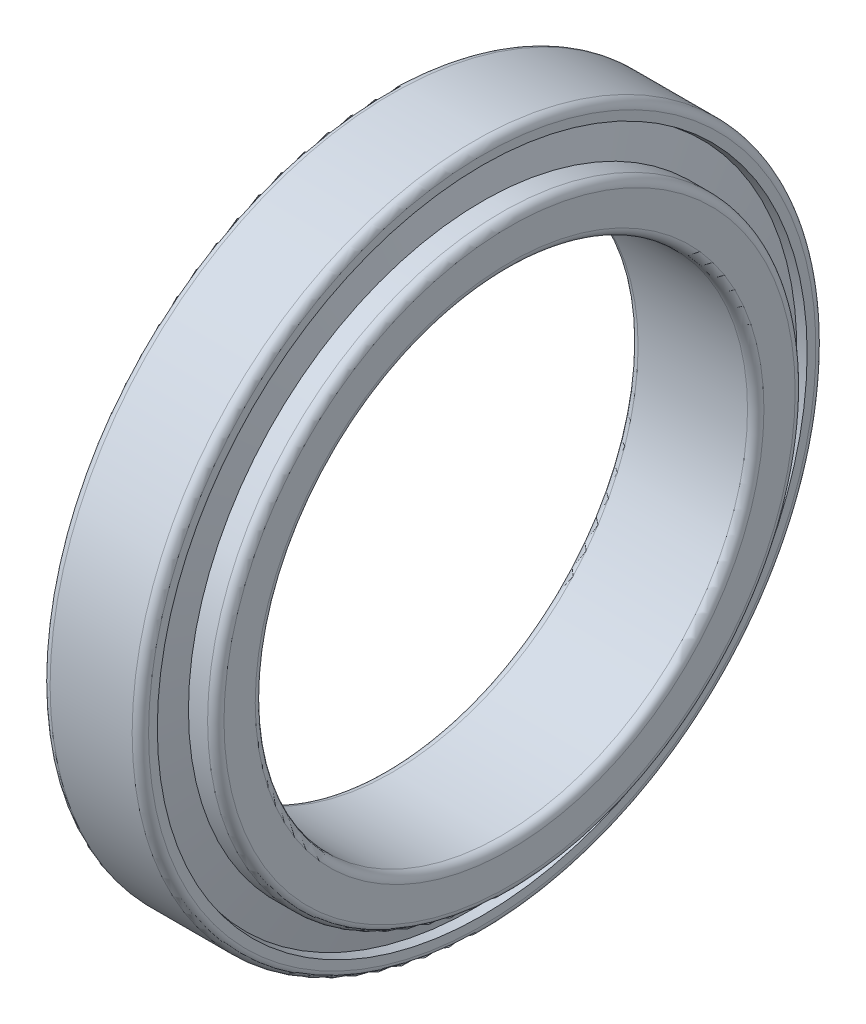
ISO-10303-21;
HEADER;
FILE_DESCRIPTION(('STEP AP214'),'2;1');
FILE_NAME('part.step','',(''),(''),'','','');
FILE_SCHEMA(('AUTOMOTIVE_DESIGN { 1 0 10303 214 1 1 1 1 }'));
ENDSEC;
DATA;
#1=APPLICATION_CONTEXT('core data for automotive mechanical design processes');
#2=APPLICATION_PROTOCOL_DEFINITION('international standard','automotive_design',2000,#1);
#3=PRODUCT_CONTEXT('',#1,'mechanical');
#4=PRODUCT('Part','Part','',(#3));
#5=PRODUCT_RELATED_PRODUCT_CATEGORY('part','',(#4));
#6=PRODUCT_DEFINITION_FORMATION('','',#4);
#7=PRODUCT_DEFINITION_CONTEXT('part definition',#1,'design');
#8=PRODUCT_DEFINITION('design','',#6,#7);
#9=PRODUCT_DEFINITION_SHAPE('','',#8);
#10=(LENGTH_UNIT() NAMED_UNIT(*) SI_UNIT(.MILLI.,.METRE.));
#11=(NAMED_UNIT(*) PLANE_ANGLE_UNIT() SI_UNIT($,.RADIAN.));
#12=(NAMED_UNIT(*) SI_UNIT($,.STERADIAN.) SOLID_ANGLE_UNIT());
#13=UNCERTAINTY_MEASURE_WITH_UNIT(LENGTH_MEASURE(1.E-05),#10,'distance_accuracy_value','');
#14=(GEOMETRIC_REPRESENTATION_CONTEXT(3) GLOBAL_UNCERTAINTY_ASSIGNED_CONTEXT((#13)) GLOBAL_UNIT_ASSIGNED_CONTEXT((#10,
#11,#12)) REPRESENTATION_CONTEXT('',''));
#15=CARTESIAN_POINT('',(0.,0.,0.));
#16=DIRECTION('',(0.,0.,1.));
#17=DIRECTION('',(1.,0.,0.));
#18=AXIS2_PLACEMENT_3D('',#15,#16,#17);
#19=CARTESIAN_POINT('',(1.68905399308084,0.,0.));
#20=DIRECTION('',(-1.,0.,0.));
#21=DIRECTION('',(0.,0.,1.));
#22=AXIS2_PLACEMENT_3D('',#19,#20,#21);
#23=CONICAL_SURFACE('',#22,55.9937609259239,1.34652151791362);
#24=CARTESIAN_POINT('',(3.37810798616178,0.,0.));
#25=DIRECTION('',(-1.,0.,0.));
#26=DIRECTION('',(0.,0.,1.));
#27=AXIS2_PLACEMENT_3D('',#24,#25,#26);
#28=CIRCLE('',#27,48.5892769703476);
#29=CARTESIAN_POINT('',(3.37810798616178,0.,48.5892769703476));
#30=VERTEX_POINT('',#29);
#31=EDGE_CURVE('E112',#30,#30,#28,.T.);
#32=ORIENTED_EDGE('',*,*,#31,.F.);
#33=EDGE_LOOP('',(#32));
#34=FACE_BOUND('',#33,.T.);
#35=CARTESIAN_POINT('',(1.68905399308084,0.,0.));
#36=DIRECTION('',(-1.,0.,0.));
#37=DIRECTION('',(0.,0.,1.));
#38=AXIS2_PLACEMENT_3D('',#35,#36,#37);
#39=CIRCLE('',#38,55.9937609259239);
#40=CARTESIAN_POINT('',(1.68905399308084,0.,55.9937609259239));
#41=VERTEX_POINT('',#40);
#42=EDGE_CURVE('E10',#41,#41,#39,.T.);
#43=ORIENTED_EDGE('',*,*,#42,.T.);
#44=EDGE_LOOP('',(#43));
#45=FACE_BOUND('',#44,.T.);
#46=ADVANCED_FACE('F37',(#34,#45),#23,.F.);
#47=CARTESIAN_POINT('',(0.,0.,0.));
#48=DIRECTION('',(1.,0.,0.));
#49=DIRECTION('',(0.,0.,-1.));
#50=AXIS2_PLACEMENT_3D('',#47,#48,#49);
#51=CONICAL_SURFACE('',#50,55.641,0.205891647084167);
#52=ORIENTED_EDGE('',*,*,#42,.F.);
#53=EDGE_LOOP('',(#52));
#54=FACE_BOUND('',#53,.T.);
#55=CARTESIAN_POINT('',(0.,0.,0.));
#56=DIRECTION('',(-1.,0.,0.));
#57=DIRECTION('',(0.,0.,1.));
#58=AXIS2_PLACEMENT_3D('',#55,#56,#57);
#59=CIRCLE('',#58,55.641);
#60=CARTESIAN_POINT('',(0.,0.,55.641));
#61=VERTEX_POINT('',#60);
#62=EDGE_CURVE('E44',#61,#61,#59,.T.);
#63=ORIENTED_EDGE('',*,*,#62,.T.);
#64=EDGE_LOOP('',(#63));
#65=FACE_BOUND('',#64,.T.);
#66=ADVANCED_FACE('F120',(#54,#65),#51,.F.);
#67=CARTESIAN_POINT('',(0.,55.641,0.));
#68=DIRECTION('',(1.,0.,0.));
#69=DIRECTION('',(0.,0.,-1.));
#70=AXIS2_PLACEMENT_3D('',#67,#68,#69);
#71=PLANE('',#70);
#72=ORIENTED_EDGE('',*,*,#62,.F.);
#73=EDGE_LOOP('',(#72));
#74=FACE_BOUND('',#73,.T.);
#75=CARTESIAN_POINT('',(0.,0.,0.));
#76=DIRECTION('',(-1.,0.,0.));
#77=DIRECTION('',(0.,0.,1.));
#78=AXIS2_PLACEMENT_3D('',#75,#76,#77);
#79=CIRCLE('',#78,61.);
#80=CARTESIAN_POINT('',(0.,0.,61.));
#81=VERTEX_POINT('',#80);
#82=EDGE_CURVE('E49',#81,#81,#79,.T.);
#83=ORIENTED_EDGE('',*,*,#82,.T.);
#84=EDGE_LOOP('',(#83));
#85=FACE_BOUND('',#84,.T.);
#86=ADVANCED_FACE('F124',(#74,#85),#71,.F.);
#87=CARTESIAN_POINT('',(1.5,0.,0.));
#88=DIRECTION('',(-1.,0.,0.));
#89=DIRECTION('',(0.,0.,1.));
#90=AXIS2_PLACEMENT_3D('',#87,#88,#89);
#91=TOROIDAL_SURFACE('',#90,61.,1.5);
#92=ORIENTED_EDGE('',*,*,#82,.F.);
#93=EDGE_LOOP('',(#92));
#94=FACE_BOUND('',#93,.T.);
#95=CARTESIAN_POINT('',(1.49999999999995,0.,0.));
#96=DIRECTION('',(-1.,0.,0.));
#97=DIRECTION('',(0.,0.,1.));
#98=AXIS2_PLACEMENT_3D('',#95,#96,#97);
#99=CIRCLE('',#98,62.5);
#100=CARTESIAN_POINT('',(1.49999999999995,0.,62.5));
#101=VERTEX_POINT('',#100);
#102=EDGE_CURVE('E54',#101,#101,#99,.T.);
#103=ORIENTED_EDGE('',*,*,#102,.T.);
#104=EDGE_LOOP('',(#103));
#105=FACE_BOUND('',#104,.T.);
#106=ADVANCED_FACE('F129',(#94,#105),#91,.T.);
#107=CARTESIAN_POINT('',(-882.527700014444,0.,0.));
#108=DIRECTION('',(-1.,0.,0.));
#109=DIRECTION('',(0.,0.,1.));
#110=AXIS2_PLACEMENT_3D('',#107,#108,#109);
#111=CYLINDRICAL_SURFACE('',#110,62.5);
#112=ORIENTED_EDGE('',*,*,#102,.F.);
#113=EDGE_LOOP('',(#112));
#114=FACE_BOUND('',#113,.T.);
#115=CARTESIAN_POINT('',(16.5,0.,0.));
#116=DIRECTION('',(-1.,0.,0.));
#117=DIRECTION('',(0.,0.,1.));
#118=AXIS2_PLACEMENT_3D('',#115,#116,#117);
#119=CIRCLE('',#118,62.5);
#120=CARTESIAN_POINT('',(16.5,0.,62.5));
#121=VERTEX_POINT('',#120);
#122=EDGE_CURVE('E60',#121,#121,#119,.T.);
#123=ORIENTED_EDGE('',*,*,#122,.T.);
#124=EDGE_LOOP('',(#123));
#125=FACE_BOUND('',#124,.T.);
#126=ADVANCED_FACE('F135',(#114,#125),#111,.T.);
#127=CARTESIAN_POINT('',(16.5,0.,0.));
#128=DIRECTION('',(-1.,0.,0.));
#129=DIRECTION('',(0.,0.,1.));
#130=AXIS2_PLACEMENT_3D('',#127,#128,#129);
#131=TOROIDAL_SURFACE('',#130,61.,1.5);
#132=ORIENTED_EDGE('',*,*,#122,.F.);
#133=EDGE_LOOP('',(#132));
#134=FACE_BOUND('',#133,.T.);
#135=CARTESIAN_POINT('',(18.,0.,0.));
#136=DIRECTION('',(-1.,0.,0.));
#137=DIRECTION('',(0.,0.,1.));
#138=AXIS2_PLACEMENT_3D('',#135,#136,#137);
#139=CIRCLE('',#138,61.);
#140=CARTESIAN_POINT('',(18.,0.,61.));
#141=VERTEX_POINT('',#140);
#142=EDGE_CURVE('E64',#141,#141,#139,.T.);
#143=ORIENTED_EDGE('',*,*,#142,.T.);
#144=EDGE_LOOP('',(#143));
#145=FACE_BOUND('',#144,.T.);
#146=ADVANCED_FACE('F139',(#134,#145),#131,.T.);
#147=CARTESIAN_POINT('',(18.,61.,0.));
#148=DIRECTION('',(-1.,0.,0.));
#149=DIRECTION('',(0.,0.,1.));
#150=AXIS2_PLACEMENT_3D('',#147,#148,#149);
#151=PLANE('',#150);
#152=ORIENTED_EDGE('',*,*,#142,.F.);
#153=EDGE_LOOP('',(#152));
#154=FACE_BOUND('',#153,.T.);
#155=CARTESIAN_POINT('',(18.,0.,0.));
#156=DIRECTION('',(-1.,0.,0.));
#157=DIRECTION('',(0.,0.,1.));
#158=AXIS2_PLACEMENT_3D('',#155,#156,#157);
#159=CIRCLE('',#158,59.4003213080464);
#160=CARTESIAN_POINT('',(18.,0.,59.4003213080464));
#161=VERTEX_POINT('',#160);
#162=EDGE_CURVE('E68',#161,#161,#159,.T.);
#163=ORIENTED_EDGE('',*,*,#162,.T.);
#164=EDGE_LOOP('',(#163));
#165=FACE_BOUND('',#164,.T.);
#166=ADVANCED_FACE('F143',(#154,#165),#151,.F.);
#167=CARTESIAN_POINT('',(16.4341079852699,0.,0.));
#168=DIRECTION('',(1.,0.,0.));
#169=DIRECTION('',(0.,0.,-1.));
#170=AXIS2_PLACEMENT_3D('',#167,#168,#169);
#171=CONICAL_SURFACE('',#170,59.0732829070978,0.205891647084127);
#172=ORIENTED_EDGE('',*,*,#162,.F.);
#173=EDGE_LOOP('',(#172));
#174=FACE_BOUND('',#173,.T.);
#175=CARTESIAN_POINT('',(16.4341079852699,0.,0.));
#176=DIRECTION('',(-1.,0.,0.));
#177=DIRECTION('',(0.,0.,1.));
#178=AXIS2_PLACEMENT_3D('',#175,#176,#177);
#179=CIRCLE('',#178,59.0732829070978);
#180=CARTESIAN_POINT('',(16.4341079852699,0.,59.0732829070978));
#181=VERTEX_POINT('',#180);
#182=EDGE_CURVE('E72',#181,#181,#179,.T.);
#183=ORIENTED_EDGE('',*,*,#182,.T.);
#184=EDGE_LOOP('',(#183));
#185=FACE_BOUND('',#184,.T.);
#186=ADVANCED_FACE('F147',(#174,#185),#171,.F.);
#187=CARTESIAN_POINT('',(18.,0.,0.));
#188=DIRECTION('',(-1.,0.,0.));
#189=DIRECTION('',(0.,0.,1.));
#190=AXIS2_PLACEMENT_3D('',#187,#188,#189);
#191=CONICAL_SURFACE('',#190,52.208717092902,1.34652151791362);
#192=ORIENTED_EDGE('',*,*,#182,.F.);
#193=EDGE_LOOP('',(#192));
#194=FACE_BOUND('',#193,.T.);
#195=CARTESIAN_POINT('',(18.,0.,0.));
#196=DIRECTION('',(-1.,0.,0.));
#197=DIRECTION('',(0.,0.,1.));
#198=AXIS2_PLACEMENT_3D('',#195,#196,#197);
#199=CIRCLE('',#198,52.208717092902);
#200=CARTESIAN_POINT('',(18.,0.,52.208717092902));
#201=VERTEX_POINT('',#200);
#202=EDGE_CURVE('E76',#201,#201,#199,.T.);
#203=ORIENTED_EDGE('',*,*,#202,.T.);
#204=EDGE_LOOP('',(#203));
#205=FACE_BOUND('',#204,.T.);
#206=ADVANCED_FACE('F151',(#194,#205),#191,.T.);
#207=CARTESIAN_POINT('',(18.,53.708717092902,0.));
#208=DIRECTION('',(1.,0.,0.));
#209=DIRECTION('',(0.,0.,-1.));
#210=AXIS2_PLACEMENT_3D('',#207,#208,#209);
#211=PLANE('',#210);
#212=ORIENTED_EDGE('',*,*,#202,.F.);
#213=EDGE_LOOP('',(#212));
#214=FACE_BOUND('',#213,.T.);
#215=CARTESIAN_POINT('',(18.,0.,0.));
#216=DIRECTION('',(-1.,0.,0.));
#217=DIRECTION('',(0.,0.,1.));
#218=AXIS2_PLACEMENT_3D('',#215,#216,#217);
#219=CIRCLE('',#218,53.708717092902);
#220=CARTESIAN_POINT('',(18.,0.,53.708717092902));
#221=VERTEX_POINT('',#220);
#222=EDGE_CURVE('E80',#221,#221,#219,.T.);
#223=ORIENTED_EDGE('',*,*,#222,.T.);
#224=EDGE_LOOP('',(#223));
#225=FACE_BOUND('',#224,.T.);
#226=ADVANCED_FACE('F155',(#214,#225),#211,.F.);
#227=CARTESIAN_POINT('',(-882.527700014444,0.,0.));
#228=DIRECTION('',(-1.,0.,0.));
#229=DIRECTION('',(0.,0.,1.));
#230=AXIS2_PLACEMENT_3D('',#227,#228,#229);
#231=CYLINDRICAL_SURFACE('',#230,53.708717092902);
#232=ORIENTED_EDGE('',*,*,#222,.F.);
#233=EDGE_LOOP('',(#232));
#234=FACE_BOUND('',#233,.T.);
#235=CARTESIAN_POINT('',(21.5,0.,0.));
#236=DIRECTION('',(-1.,0.,0.));
#237=DIRECTION('',(0.,0.,1.));
#238=AXIS2_PLACEMENT_3D('',#235,#236,#237);
#239=CIRCLE('',#238,53.708717092902);
#240=CARTESIAN_POINT('',(21.5,0.,53.708717092902));
#241=VERTEX_POINT('',#240);
#242=EDGE_CURVE('E84',#241,#241,#239,.T.);
#243=ORIENTED_EDGE('',*,*,#242,.T.);
#244=EDGE_LOOP('',(#243));
#245=FACE_BOUND('',#244,.T.);
#246=ADVANCED_FACE('F159',(#234,#245),#231,.T.);
#247=CARTESIAN_POINT('',(21.5,0.,0.));
#248=DIRECTION('',(-1.,0.,0.));
#249=DIRECTION('',(0.,0.,1.));
#250=AXIS2_PLACEMENT_3D('',#247,#248,#249);
#251=TOROIDAL_SURFACE('',#250,52.208717092902,1.5);
#252=ORIENTED_EDGE('',*,*,#242,.F.);
#253=EDGE_LOOP('',(#252));
#254=FACE_BOUND('',#253,.T.);
#255=CARTESIAN_POINT('',(23.,0.,0.));
#256=DIRECTION('',(-1.,0.,0.));
#257=DIRECTION('',(0.,0.,1.));
#258=AXIS2_PLACEMENT_3D('',#255,#256,#257);
#259=CIRCLE('',#258,52.208717092902);
#260=CARTESIAN_POINT('',(23.,0.,52.208717092902));
#261=VERTEX_POINT('',#260);
#262=EDGE_CURVE('E88',#261,#261,#259,.T.);
#263=ORIENTED_EDGE('',*,*,#262,.T.);
#264=EDGE_LOOP('',(#263));
#265=FACE_BOUND('',#264,.T.);
#266=ADVANCED_FACE('F163',(#254,#265),#251,.T.);
#267=CARTESIAN_POINT('',(23.,46.5,0.));
#268=DIRECTION('',(-1.,0.,0.));
#269=DIRECTION('',(0.,0.,1.));
#270=AXIS2_PLACEMENT_3D('',#267,#268,#269);
#271=PLANE('',#270);
#272=ORIENTED_EDGE('',*,*,#262,.F.);
#273=EDGE_LOOP('',(#272));
#274=FACE_BOUND('',#273,.T.);
#275=CARTESIAN_POINT('',(23.,0.,0.));
#276=DIRECTION('',(-1.,0.,0.));
#277=DIRECTION('',(0.,0.,1.));
#278=AXIS2_PLACEMENT_3D('',#275,#276,#277);
#279=CIRCLE('',#278,46.5);
#280=CARTESIAN_POINT('',(23.,0.,46.5));
#281=VERTEX_POINT('',#280);
#282=EDGE_CURVE('E92',#281,#281,#279,.T.);
#283=ORIENTED_EDGE('',*,*,#282,.T.);
#284=EDGE_LOOP('',(#283));
#285=FACE_BOUND('',#284,.T.);
#286=ADVANCED_FACE('F167',(#274,#285),#271,.F.);
#287=CARTESIAN_POINT('',(21.5,0.,0.));
#288=DIRECTION('',(-1.,0.,0.));
#289=DIRECTION('',(0.,0.,1.));
#290=AXIS2_PLACEMENT_3D('',#287,#288,#289);
#291=TOROIDAL_SURFACE('',#290,46.5,1.5);
#292=ORIENTED_EDGE('',*,*,#282,.F.);
#293=EDGE_LOOP('',(#292));
#294=FACE_BOUND('',#293,.T.);
#295=CARTESIAN_POINT('',(21.5,0.,0.));
#296=DIRECTION('',(-1.,0.,0.));
#297=DIRECTION('',(0.,0.,1.));
#298=AXIS2_PLACEMENT_3D('',#295,#296,#297);
#299=CIRCLE('',#298,45.);
#300=CARTESIAN_POINT('',(21.5,0.,45.));
#301=VERTEX_POINT('',#300);
#302=EDGE_CURVE('E96',#301,#301,#299,.T.);
#303=ORIENTED_EDGE('',*,*,#302,.T.);
#304=EDGE_LOOP('',(#303));
#305=FACE_BOUND('',#304,.T.);
#306=ADVANCED_FACE('F171',(#294,#305),#291,.T.);
#307=CARTESIAN_POINT('',(-882.527700014444,0.,0.));
#308=DIRECTION('',(-1.,0.,0.));
#309=DIRECTION('',(0.,0.,1.));
#310=AXIS2_PLACEMENT_3D('',#307,#308,#309);
#311=CYLINDRICAL_SURFACE('',#310,45.);
#312=ORIENTED_EDGE('',*,*,#302,.F.);
#313=EDGE_LOOP('',(#312));
#314=FACE_BOUND('',#313,.T.);
#315=CARTESIAN_POINT('',(1.49999999999995,0.,0.));
#316=DIRECTION('',(-1.,0.,0.));
#317=DIRECTION('',(0.,0.,1.));
#318=AXIS2_PLACEMENT_3D('',#315,#316,#317);
#319=CIRCLE('',#318,45.);
#320=CARTESIAN_POINT('',(1.49999999999995,0.,45.));
#321=VERTEX_POINT('',#320);
#322=EDGE_CURVE('E100',#321,#321,#319,.T.);
#323=ORIENTED_EDGE('',*,*,#322,.T.);
#324=EDGE_LOOP('',(#323));
#325=FACE_BOUND('',#324,.T.);
#326=ADVANCED_FACE('F175',(#314,#325),#311,.F.);
#327=CARTESIAN_POINT('',(1.5,0.,0.));
#328=DIRECTION('',(-1.,0.,0.));
#329=DIRECTION('',(0.,0.,1.));
#330=AXIS2_PLACEMENT_3D('',#327,#328,#329);
#331=TOROIDAL_SURFACE('',#330,46.5,1.5);
#332=ORIENTED_EDGE('',*,*,#322,.F.);
#333=EDGE_LOOP('',(#332));
#334=FACE_BOUND('',#333,.T.);
#335=CARTESIAN_POINT('',(0.,0.,0.));
#336=DIRECTION('',(-1.,0.,0.));
#337=DIRECTION('',(0.,0.,1.));
#338=AXIS2_PLACEMENT_3D('',#335,#336,#337);
#339=CIRCLE('',#338,46.5);
#340=CARTESIAN_POINT('',(0.,0.,46.5));
#341=VERTEX_POINT('',#340);
#342=EDGE_CURVE('E104',#341,#341,#339,.T.);
#343=ORIENTED_EDGE('',*,*,#342,.T.);
#344=EDGE_LOOP('',(#343));
#345=FACE_BOUND('',#344,.T.);
#346=ADVANCED_FACE('F179',(#334,#345),#331,.T.);
#347=CARTESIAN_POINT('',(0.,48.5892769703476,0.));
#348=DIRECTION('',(1.,0.,0.));
#349=DIRECTION('',(0.,0.,-1.));
#350=AXIS2_PLACEMENT_3D('',#347,#348,#349);
#351=PLANE('',#350);
#352=ORIENTED_EDGE('',*,*,#342,.F.);
#353=EDGE_LOOP('',(#352));
#354=FACE_BOUND('',#353,.T.);
#355=CARTESIAN_POINT('',(0.,0.,0.));
#356=DIRECTION('',(-1.,0.,0.));
#357=DIRECTION('',(0.,0.,1.));
#358=AXIS2_PLACEMENT_3D('',#355,#356,#357);
#359=CIRCLE('',#358,48.5892769703476);
#360=CARTESIAN_POINT('',(0.,0.,48.5892769703476));
#361=VERTEX_POINT('',#360);
#362=EDGE_CURVE('E108',#361,#361,#359,.T.);
#363=ORIENTED_EDGE('',*,*,#362,.T.);
#364=EDGE_LOOP('',(#363));
#365=FACE_BOUND('',#364,.T.);
#366=ADVANCED_FACE('F183',(#354,#365),#351,.F.);
#367=CARTESIAN_POINT('',(-882.527700014444,0.,0.));
#368=DIRECTION('',(-1.,0.,0.));
#369=DIRECTION('',(0.,0.,1.));
#370=AXIS2_PLACEMENT_3D('',#367,#368,#369);
#371=CYLINDRICAL_SURFACE('',#370,48.5892769703476);
#372=ORIENTED_EDGE('',*,*,#362,.F.);
#373=EDGE_LOOP('',(#372));
#374=FACE_BOUND('',#373,.T.);
#375=ORIENTED_EDGE('',*,*,#31,.T.);
#376=EDGE_LOOP('',(#375));
#377=FACE_BOUND('',#376,.T.);
#378=ADVANCED_FACE('F117',(#374,#377),#371,.T.);
#379=CLOSED_SHELL('',(#46,#66,#86,#106,#126,#146,#166,#186,#206,#226,#246,#266,#286,#306,#326,
#346,#366,#378));
#380=MANIFOLD_SOLID_BREP('B2',#379);
#381=ADVANCED_BREP_SHAPE_REPRESENTATION('',(#18,#380),#14);
#382=SHAPE_DEFINITION_REPRESENTATION(#9,#381);
ENDSEC;
END-ISO-10303-21;
